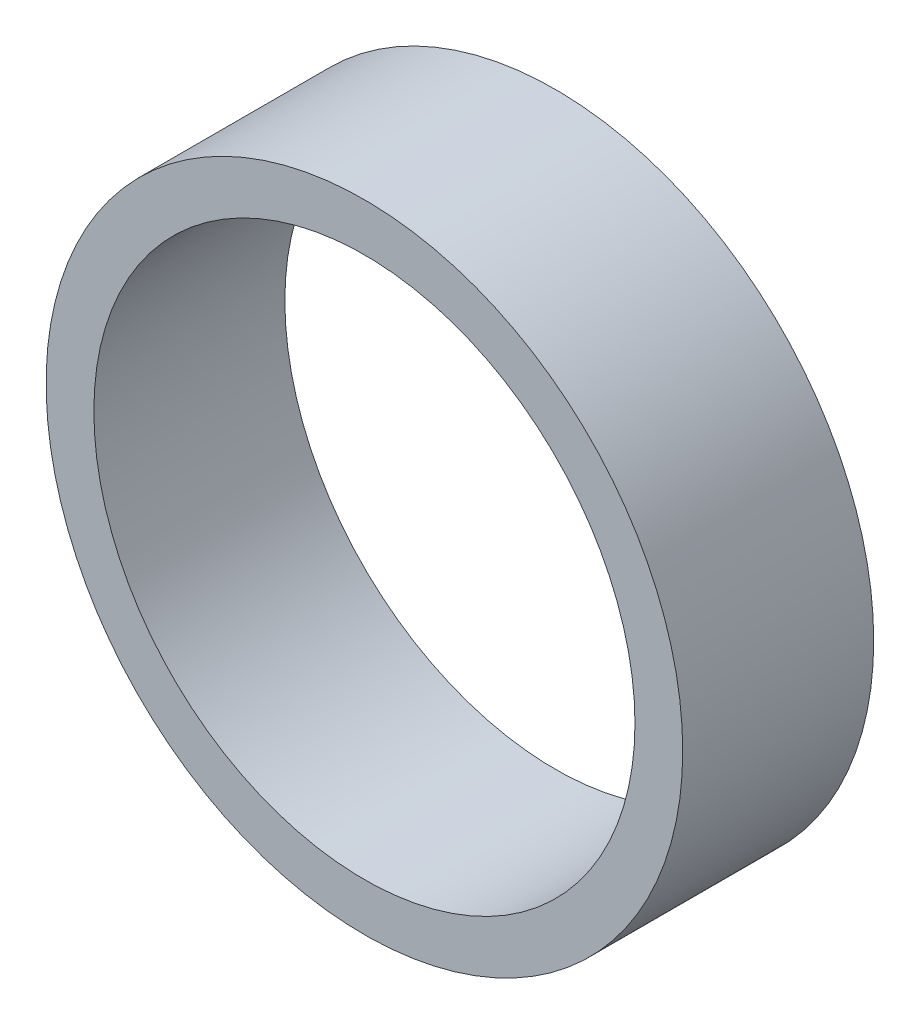
ISO-10303-21;
HEADER;
FILE_DESCRIPTION(('STEP AP214'),'2;1');
FILE_NAME('part.step','',(''),(''),'','','');
FILE_SCHEMA(('AUTOMOTIVE_DESIGN { 1 0 10303 214 1 1 1 1 }'));
ENDSEC;
DATA;
#1=APPLICATION_CONTEXT('core data for automotive mechanical design processes');
#2=APPLICATION_PROTOCOL_DEFINITION('international standard','automotive_design',2000,#1);
#3=PRODUCT_CONTEXT('',#1,'mechanical');
#4=PRODUCT('Part','Part','',(#3));
#5=PRODUCT_RELATED_PRODUCT_CATEGORY('part','',(#4));
#6=PRODUCT_DEFINITION_FORMATION('','',#4);
#7=PRODUCT_DEFINITION_CONTEXT('part definition',#1,'design');
#8=PRODUCT_DEFINITION('design','',#6,#7);
#9=PRODUCT_DEFINITION_SHAPE('','',#8);
#10=(LENGTH_UNIT() NAMED_UNIT(*) SI_UNIT(.MILLI.,.METRE.));
#11=(NAMED_UNIT(*) PLANE_ANGLE_UNIT() SI_UNIT($,.RADIAN.));
#12=(NAMED_UNIT(*) SI_UNIT($,.STERADIAN.) SOLID_ANGLE_UNIT());
#13=UNCERTAINTY_MEASURE_WITH_UNIT(LENGTH_MEASURE(1.E-05),#10,'distance_accuracy_value','');
#14=(GEOMETRIC_REPRESENTATION_CONTEXT(3) GLOBAL_UNCERTAINTY_ASSIGNED_CONTEXT((#13)) GLOBAL_UNIT_ASSIGNED_CONTEXT((#10,
#11,#12)) REPRESENTATION_CONTEXT('',''));
#15=CARTESIAN_POINT('',(0.,0.,0.));
#16=DIRECTION('',(0.,0.,1.));
#17=DIRECTION('',(1.,0.,0.));
#18=AXIS2_PLACEMENT_3D('',#15,#16,#17);
#19=CARTESIAN_POINT('',(0.,0.,6.));
#20=DIRECTION('',(0.,0.,1.));
#21=DIRECTION('',(1.,0.,0.));
#22=AXIS2_PLACEMENT_3D('',#19,#20,#21);
#23=PLANE('',#22);
#24=CARTESIAN_POINT('',(0.,0.,6.));
#25=DIRECTION('',(0.,0.,1.));
#26=DIRECTION('',(1.,0.,0.));
#27=AXIS2_PLACEMENT_3D('',#24,#25,#26);
#28=CIRCLE('',#27,10.);
#29=CARTESIAN_POINT('',(10.,0.,6.));
#30=VERTEX_POINT('',#29);
#31=EDGE_CURVE('E10',#30,#30,#28,.T.);
#32=ORIENTED_EDGE('',*,*,#31,.T.);
#33=EDGE_LOOP('',(#32));
#34=FACE_BOUND('',#33,.T.);
#35=CARTESIAN_POINT('',(0.,0.,6.));
#36=DIRECTION('',(0.,0.,1.));
#37=DIRECTION('',(1.,0.,0.));
#38=AXIS2_PLACEMENT_3D('',#35,#36,#37);
#39=CIRCLE('',#38,8.5);
#40=CARTESIAN_POINT('',(8.5,0.,6.));
#41=VERTEX_POINT('',#40);
#42=EDGE_CURVE('E42',#41,#41,#39,.T.);
#43=ORIENTED_EDGE('',*,*,#42,.F.);
#44=EDGE_LOOP('',(#43));
#45=FACE_BOUND('',#44,.T.);
#46=ADVANCED_FACE('F31',(#34,#45),#23,.T.);
#47=CARTESIAN_POINT('',(0.,0.,0.));
#48=DIRECTION('',(0.,0.,1.));
#49=DIRECTION('',(1.,0.,0.));
#50=AXIS2_PLACEMENT_3D('',#47,#48,#49);
#51=PLANE('',#50);
#52=CARTESIAN_POINT('',(0.,0.,0.));
#53=DIRECTION('',(0.,0.,1.));
#54=DIRECTION('',(1.,0.,0.));
#55=AXIS2_PLACEMENT_3D('',#52,#53,#54);
#56=CIRCLE('',#55,10.);
#57=CARTESIAN_POINT('',(10.,0.,0.));
#58=VERTEX_POINT('',#57);
#59=EDGE_CURVE('E35',#58,#58,#56,.T.);
#60=ORIENTED_EDGE('',*,*,#59,.F.);
#61=EDGE_LOOP('',(#60));
#62=FACE_BOUND('',#61,.T.);
#63=CARTESIAN_POINT('',(0.,0.,0.));
#64=DIRECTION('',(0.,0.,1.));
#65=DIRECTION('',(1.,0.,0.));
#66=AXIS2_PLACEMENT_3D('',#63,#64,#65);
#67=CIRCLE('',#66,8.5);
#68=CARTESIAN_POINT('',(8.5,0.,0.));
#69=VERTEX_POINT('',#68);
#70=EDGE_CURVE('E44',#69,#69,#67,.T.);
#71=ORIENTED_EDGE('',*,*,#70,.T.);
#72=EDGE_LOOP('',(#71));
#73=FACE_BOUND('',#72,.T.);
#74=ADVANCED_FACE('F54',(#62,#73),#51,.F.);
#75=CARTESIAN_POINT('',(0.,0.,6.));
#76=DIRECTION('',(0.,0.,-1.));
#77=DIRECTION('',(-1.,0.,0.));
#78=AXIS2_PLACEMENT_3D('',#75,#76,#77);
#79=CYLINDRICAL_SURFACE('',#78,10.);
#80=ORIENTED_EDGE('',*,*,#31,.F.);
#81=EDGE_LOOP('',(#80));
#82=FACE_BOUND('',#81,.T.);
#83=ORIENTED_EDGE('',*,*,#59,.T.);
#84=EDGE_LOOP('',(#83));
#85=FACE_BOUND('',#84,.T.);
#86=ADVANCED_FACE('F33',(#82,#85),#79,.T.);
#87=CARTESIAN_POINT('',(0.,0.,6.));
#88=DIRECTION('',(0.,0.,-1.));
#89=DIRECTION('',(-1.,0.,0.));
#90=AXIS2_PLACEMENT_3D('',#87,#88,#89);
#91=CYLINDRICAL_SURFACE('',#90,8.5);
#92=ORIENTED_EDGE('',*,*,#42,.T.);
#93=EDGE_LOOP('',(#92));
#94=FACE_BOUND('',#93,.T.);
#95=ORIENTED_EDGE('',*,*,#70,.F.);
#96=EDGE_LOOP('',(#95));
#97=FACE_BOUND('',#96,.T.);
#98=ADVANCED_FACE('F50',(#94,#97),#91,.F.);
#99=CLOSED_SHELL('',(#46,#74,#86,#98));
#100=MANIFOLD_SOLID_BREP('B2',#99);
#101=ADVANCED_BREP_SHAPE_REPRESENTATION('',(#18,#100),#14);
#102=SHAPE_DEFINITION_REPRESENTATION(#9,#101);
ENDSEC;
END-ISO-10303-21;
